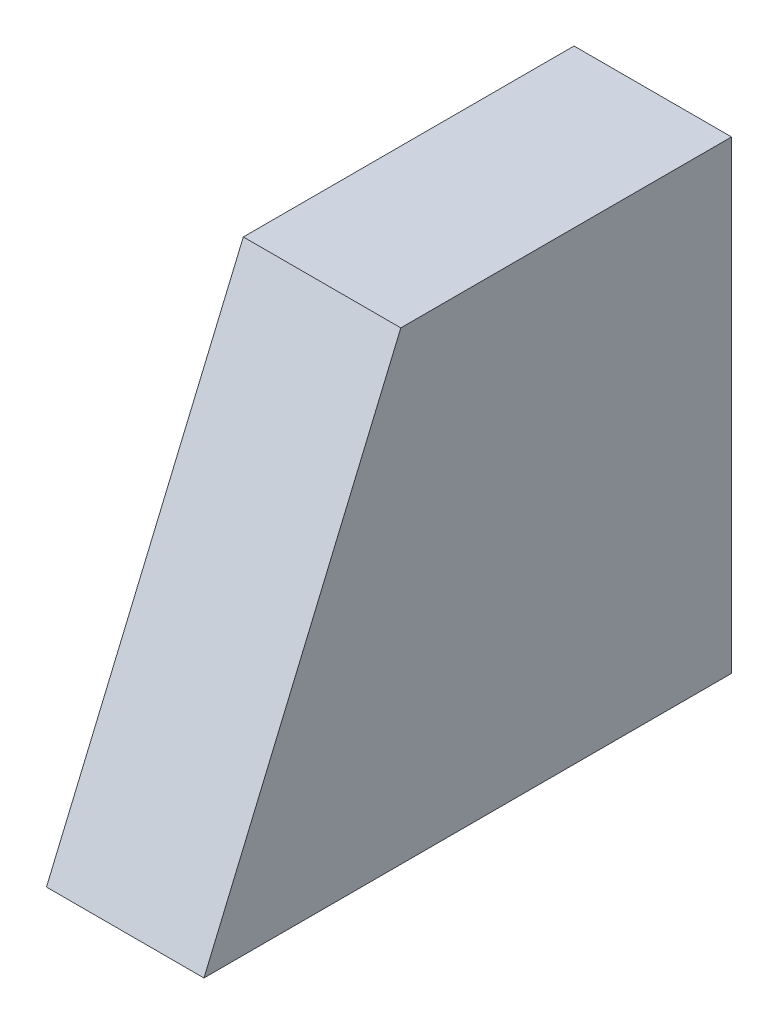
ISO-10303-21;
HEADER;
FILE_DESCRIPTION(('STEP AP214'),'2;1');
FILE_NAME('part.step','',(''),(''),'','','');
FILE_SCHEMA(('AUTOMOTIVE_DESIGN { 1 0 10303 214 1 1 1 1 }'));
ENDSEC;
DATA;
#1=APPLICATION_CONTEXT('core data for automotive mechanical design processes');
#2=APPLICATION_PROTOCOL_DEFINITION('international standard','automotive_design',2000,#1);
#3=PRODUCT_CONTEXT('',#1,'mechanical');
#4=PRODUCT('Part','Part','',(#3));
#5=PRODUCT_RELATED_PRODUCT_CATEGORY('part','',(#4));
#6=PRODUCT_DEFINITION_FORMATION('','',#4);
#7=PRODUCT_DEFINITION_CONTEXT('part definition',#1,'design');
#8=PRODUCT_DEFINITION('design','',#6,#7);
#9=PRODUCT_DEFINITION_SHAPE('','',#8);
#10=(LENGTH_UNIT() NAMED_UNIT(*) SI_UNIT(.MILLI.,.METRE.));
#11=(NAMED_UNIT(*) PLANE_ANGLE_UNIT() SI_UNIT($,.RADIAN.));
#12=(NAMED_UNIT(*) SI_UNIT($,.STERADIAN.) SOLID_ANGLE_UNIT());
#13=UNCERTAINTY_MEASURE_WITH_UNIT(LENGTH_MEASURE(1.E-05),#10,'distance_accuracy_value','');
#14=(GEOMETRIC_REPRESENTATION_CONTEXT(3) GLOBAL_UNCERTAINTY_ASSIGNED_CONTEXT((#13)) GLOBAL_UNIT_ASSIGNED_CONTEXT((#10,
#11,#12)) REPRESENTATION_CONTEXT('',''));
#15=CARTESIAN_POINT('',(0.,0.,0.));
#16=DIRECTION('',(0.,0.,1.));
#17=DIRECTION('',(1.,0.,0.));
#18=AXIS2_PLACEMENT_3D('',#15,#16,#17);
#19=CARTESIAN_POINT('',(100.,0.,335.));
#20=DIRECTION('',(0.,1.,0.));
#21=DIRECTION('',(0.,0.,1.));
#22=AXIS2_PLACEMENT_3D('',#19,#20,#21);
#23=PLANE('',#22);
#24=DIRECTION('',(0.,0.,-1.));
#25=VECTOR('',#24,1.);
#26=CARTESIAN_POINT('',(0.,0.,335.));
#27=LINE('',#26,#25);
#28=CARTESIAN_POINT('',(0.,0.,335.));
#29=VERTEX_POINT('',#28);
#30=CARTESIAN_POINT('',(0.,0.,0.));
#31=VERTEX_POINT('',#30);
#32=EDGE_CURVE('E96',#29,#31,#27,.T.);
#33=ORIENTED_EDGE('',*,*,#32,.T.);
#34=DIRECTION('',(-1.,0.,0.));
#35=VECTOR('',#34,1.);
#36=CARTESIAN_POINT('',(100.,0.,0.));
#37=LINE('',#36,#35);
#38=CARTESIAN_POINT('',(100.,0.,0.));
#39=VERTEX_POINT('',#38);
#40=EDGE_CURVE('E11',#39,#31,#37,.T.);
#41=ORIENTED_EDGE('',*,*,#40,.F.);
#42=DIRECTION('',(0.,0.,-1.));
#43=VECTOR('',#42,1.);
#44=CARTESIAN_POINT('',(100.,0.,335.));
#45=LINE('',#44,#43);
#46=CARTESIAN_POINT('',(100.,0.,335.));
#47=VERTEX_POINT('',#46);
#48=EDGE_CURVE('E84',#47,#39,#45,.T.);
#49=ORIENTED_EDGE('',*,*,#48,.F.);
#50=DIRECTION('',(-1.,0.,0.));
#51=VECTOR('',#50,1.);
#52=CARTESIAN_POINT('',(100.,0.,335.));
#53=LINE('',#52,#51);
#54=EDGE_CURVE('E92',#47,#29,#53,.T.);
#55=ORIENTED_EDGE('',*,*,#54,.T.);
#56=EDGE_LOOP('',(#33,#41,#49,#55));
#57=FACE_BOUND('',#56,.T.);
#58=ADVANCED_FACE('F33',(#57),#23,.F.);
#59=CARTESIAN_POINT('',(100.,0.,0.));
#60=DIRECTION('',(0.,0.,1.));
#61=DIRECTION('',(1.,0.,0.));
#62=AXIS2_PLACEMENT_3D('',#59,#60,#61);
#63=PLANE('',#62);
#64=DIRECTION('',(0.,1.,0.));
#65=VECTOR('',#64,1.);
#66=CARTESIAN_POINT('',(0.,0.,0.));
#67=LINE('',#66,#65);
#68=CARTESIAN_POINT('',(0.,295.,0.));
#69=VERTEX_POINT('',#68);
#70=EDGE_CURVE('E88',#31,#69,#67,.T.);
#71=ORIENTED_EDGE('',*,*,#70,.T.);
#72=DIRECTION('',(-1.,0.,0.));
#73=VECTOR('',#72,1.);
#74=CARTESIAN_POINT('',(100.,295.,0.));
#75=LINE('',#74,#73);
#76=CARTESIAN_POINT('',(100.,295.,0.));
#77=VERTEX_POINT('',#76);
#78=EDGE_CURVE('E41',#77,#69,#75,.T.);
#79=ORIENTED_EDGE('',*,*,#78,.F.);
#80=DIRECTION('',(0.,1.,0.));
#81=VECTOR('',#80,1.);
#82=CARTESIAN_POINT('',(100.,0.,0.));
#83=LINE('',#82,#81);
#84=EDGE_CURVE('E79',#39,#77,#83,.T.);
#85=ORIENTED_EDGE('',*,*,#84,.F.);
#86=ORIENTED_EDGE('',*,*,#40,.T.);
#87=EDGE_LOOP('',(#71,#79,#85,#86));
#88=FACE_BOUND('',#87,.T.);
#89=ADVANCED_FACE('F87',(#88),#63,.F.);
#90=CARTESIAN_POINT('',(100.,295.,0.));
#91=DIRECTION('',(0.,-1.,0.));
#92=DIRECTION('',(0.,0.,-1.));
#93=AXIS2_PLACEMENT_3D('',#90,#91,#92);
#94=PLANE('',#93);
#95=DIRECTION('',(0.,0.,1.));
#96=VECTOR('',#95,1.);
#97=CARTESIAN_POINT('',(0.,295.,0.));
#98=LINE('',#97,#96);
#99=CARTESIAN_POINT('',(0.,295.,210.));
#100=VERTEX_POINT('',#99);
#101=EDGE_CURVE('E66',#69,#100,#98,.T.);
#102=ORIENTED_EDGE('',*,*,#101,.T.);
#103=DIRECTION('',(-1.,0.,0.));
#104=VECTOR('',#103,1.);
#105=CARTESIAN_POINT('',(100.,295.,210.));
#106=LINE('',#105,#104);
#107=CARTESIAN_POINT('',(100.,295.,210.));
#108=VERTEX_POINT('',#107);
#109=EDGE_CURVE('E89',#108,#100,#106,.T.);
#110=ORIENTED_EDGE('',*,*,#109,.F.);
#111=DIRECTION('',(0.,0.,1.));
#112=VECTOR('',#111,1.);
#113=CARTESIAN_POINT('',(100.,295.,0.));
#114=LINE('',#113,#112);
#115=EDGE_CURVE('E82',#77,#108,#114,.T.);
#116=ORIENTED_EDGE('',*,*,#115,.F.);
#117=ORIENTED_EDGE('',*,*,#78,.T.);
#118=EDGE_LOOP('',(#102,#110,#116,#117));
#119=FACE_BOUND('',#118,.T.);
#120=ADVANCED_FACE('F90',(#119),#94,.F.);
#121=CARTESIAN_POINT('',(100.,295.,210.));
#122=DIRECTION('',(0.,-0.39014903418414,-0.920751720674571));
#123=DIRECTION('',(0.,0.920751720674571,-0.39014903418414));
#124=AXIS2_PLACEMENT_3D('',#121,#122,#123);
#125=PLANE('',#124);
#126=DIRECTION('',(0.,-0.920751720674571,0.39014903418414));
#127=VECTOR('',#126,1.);
#128=CARTESIAN_POINT('',(0.,295.,210.));
#129=LINE('',#128,#127);
#130=EDGE_CURVE('E72',#100,#29,#129,.T.);
#131=ORIENTED_EDGE('',*,*,#130,.T.);
#132=ORIENTED_EDGE('',*,*,#54,.F.);
#133=DIRECTION('',(0.,-0.920751720674571,0.39014903418414));
#134=VECTOR('',#133,1.);
#135=CARTESIAN_POINT('',(100.,295.,210.));
#136=LINE('',#135,#134);
#137=EDGE_CURVE('E49',#108,#47,#136,.T.);
#138=ORIENTED_EDGE('',*,*,#137,.F.);
#139=ORIENTED_EDGE('',*,*,#109,.T.);
#140=EDGE_LOOP('',(#131,#132,#138,#139));
#141=FACE_BOUND('',#140,.T.);
#142=ADVANCED_FACE('F103',(#141),#125,.F.);
#143=CARTESIAN_POINT('',(100.,0.,0.));
#144=DIRECTION('',(1.,0.,0.));
#145=DIRECTION('',(0.,0.,-1.));
#146=AXIS2_PLACEMENT_3D('',#143,#144,#145);
#147=PLANE('',#146);
#148=ORIENTED_EDGE('',*,*,#48,.T.);
#149=ORIENTED_EDGE('',*,*,#84,.T.);
#150=ORIENTED_EDGE('',*,*,#115,.T.);
#151=ORIENTED_EDGE('',*,*,#137,.T.);
#152=EDGE_LOOP('',(#148,#149,#150,#151));
#153=FACE_BOUND('',#152,.T.);
#154=ADVANCED_FACE('F80',(#153),#147,.T.);
#155=CARTESIAN_POINT('',(0.,0.,0.));
#156=DIRECTION('',(1.,0.,0.));
#157=DIRECTION('',(0.,0.,-1.));
#158=AXIS2_PLACEMENT_3D('',#155,#156,#157);
#159=PLANE('',#158);
#160=ORIENTED_EDGE('',*,*,#32,.F.);
#161=ORIENTED_EDGE('',*,*,#130,.F.);
#162=ORIENTED_EDGE('',*,*,#101,.F.);
#163=ORIENTED_EDGE('',*,*,#70,.F.);
#164=EDGE_LOOP('',(#160,#161,#162,#163));
#165=FACE_BOUND('',#164,.T.);
#166=ADVANCED_FACE('F106',(#165),#159,.F.);
#167=CLOSED_SHELL('',(#58,#89,#120,#142,#154,#166));
#168=MANIFOLD_SOLID_BREP('B2',#167);
#169=ADVANCED_BREP_SHAPE_REPRESENTATION('',(#18,#168),#14);
#170=SHAPE_DEFINITION_REPRESENTATION(#9,#169);
ENDSEC;
END-ISO-10303-21;
